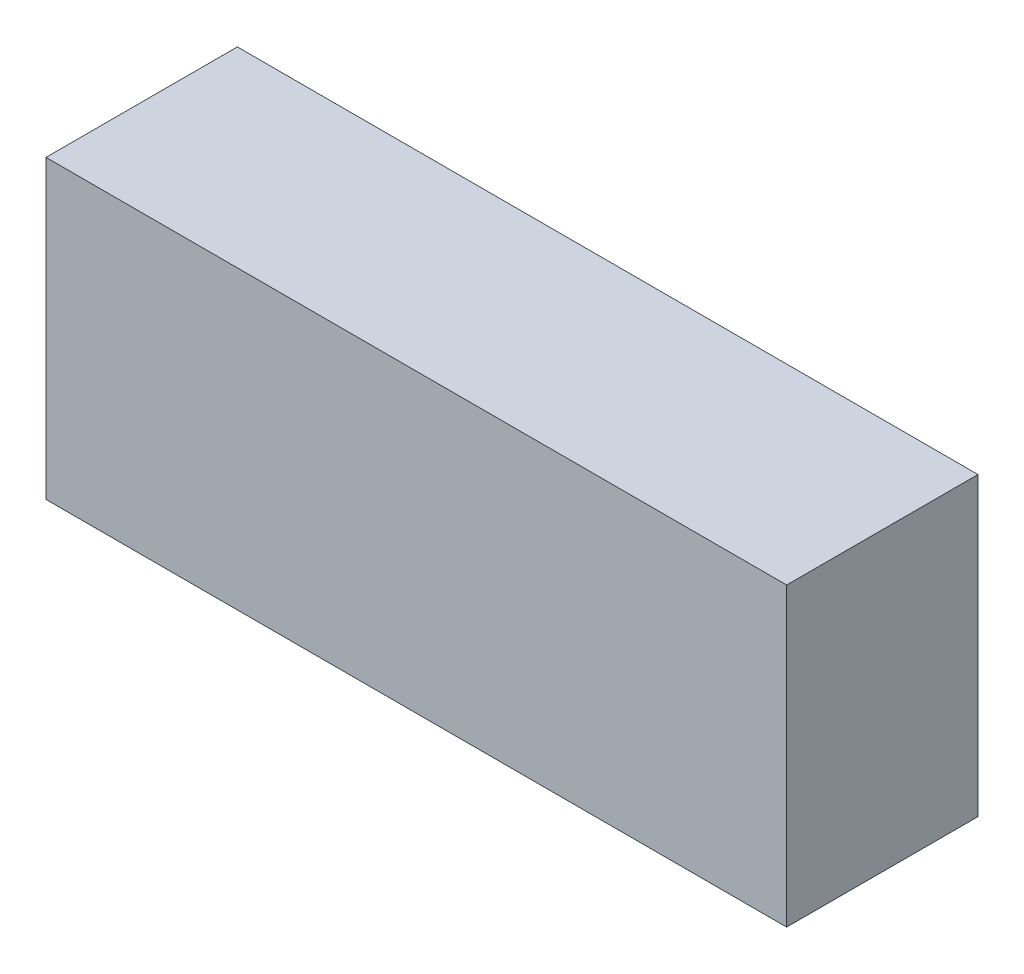
ISO-10303-21;
HEADER;
FILE_DESCRIPTION(('STEP AP214'),'2;1');
FILE_NAME('part.step','',(''),(''),'','','');
FILE_SCHEMA(('AUTOMOTIVE_DESIGN { 1 0 10303 214 1 1 1 1 }'));
ENDSEC;
DATA;
#1=APPLICATION_CONTEXT('core data for automotive mechanical design processes');
#2=APPLICATION_PROTOCOL_DEFINITION('international standard','automotive_design',2000,#1);
#3=PRODUCT_CONTEXT('',#1,'mechanical');
#4=PRODUCT('Part','Part','',(#3));
#5=PRODUCT_RELATED_PRODUCT_CATEGORY('part','',(#4));
#6=PRODUCT_DEFINITION_FORMATION('','',#4);
#7=PRODUCT_DEFINITION_CONTEXT('part definition',#1,'design');
#8=PRODUCT_DEFINITION('design','',#6,#7);
#9=PRODUCT_DEFINITION_SHAPE('','',#8);
#10=(LENGTH_UNIT() NAMED_UNIT(*) SI_UNIT(.MILLI.,.METRE.));
#11=(NAMED_UNIT(*) PLANE_ANGLE_UNIT() SI_UNIT($,.RADIAN.));
#12=(NAMED_UNIT(*) SI_UNIT($,.STERADIAN.) SOLID_ANGLE_UNIT());
#13=UNCERTAINTY_MEASURE_WITH_UNIT(LENGTH_MEASURE(1.E-05),#10,'distance_accuracy_value','');
#14=(GEOMETRIC_REPRESENTATION_CONTEXT(3) GLOBAL_UNCERTAINTY_ASSIGNED_CONTEXT((#13)) GLOBAL_UNIT_ASSIGNED_CONTEXT((#10,
#11,#12)) REPRESENTATION_CONTEXT('',''));
#15=CARTESIAN_POINT('',(0.,0.,0.));
#16=DIRECTION('',(0.,0.,1.));
#17=DIRECTION('',(1.,0.,0.));
#18=AXIS2_PLACEMENT_3D('',#15,#16,#17);
#19=CARTESIAN_POINT('',(-0.9,4.04,0.31));
#20=DIRECTION('',(0.,0.,1.));
#21=DIRECTION('',(1.,0.,0.));
#22=AXIS2_PLACEMENT_3D('',#19,#20,#21);
#23=PLANE('',#22);
#24=DIRECTION('',(1.,0.,0.));
#25=VECTOR('',#24,1.);
#26=CARTESIAN_POINT('',(-0.9,3.56,0.31));
#27=LINE('',#26,#25);
#28=CARTESIAN_POINT('',(0.3,3.56,0.31));
#29=VERTEX_POINT('',#28);
#30=CARTESIAN_POINT('',(-0.9,3.56,0.31));
#31=VERTEX_POINT('',#30);
#32=EDGE_CURVE('E76',#29,#31,#27,.F.);
#33=ORIENTED_EDGE('',*,*,#32,.F.);
#34=DIRECTION('',(0.,1.,0.));
#35=VECTOR('',#34,1.);
#36=CARTESIAN_POINT('',(0.3,4.04,0.31));
#37=LINE('',#36,#35);
#38=CARTESIAN_POINT('',(0.3,4.04,0.31));
#39=VERTEX_POINT('',#38);
#40=EDGE_CURVE('E58',#39,#29,#37,.F.);
#41=ORIENTED_EDGE('',*,*,#40,.F.);
#42=DIRECTION('',(1.,0.,0.));
#43=VECTOR('',#42,1.);
#44=CARTESIAN_POINT('',(-0.9,4.04,0.31));
#45=LINE('',#44,#43);
#46=CARTESIAN_POINT('',(-0.9,4.04,0.31));
#47=VERTEX_POINT('',#46);
#48=EDGE_CURVE('E20',#39,#47,#45,.F.);
#49=ORIENTED_EDGE('',*,*,#48,.T.);
#50=DIRECTION('',(0.,1.,0.));
#51=VECTOR('',#50,1.);
#52=CARTESIAN_POINT('',(-0.9,4.04,0.31));
#53=LINE('',#52,#51);
#54=EDGE_CURVE('E55',#47,#31,#53,.F.);
#55=ORIENTED_EDGE('',*,*,#54,.T.);
#56=EDGE_LOOP('',(#33,#41,#49,#55));
#57=FACE_BOUND('',#56,.T.);
#58=ADVANCED_FACE('F17',(#57),#23,.T.);
#59=CARTESIAN_POINT('',(-0.9,4.04,0.));
#60=DIRECTION('',(0.,-1.,0.));
#61=DIRECTION('',(1.,0.,0.));
#62=AXIS2_PLACEMENT_3D('',#59,#60,#61);
#63=PLANE('',#62);
#64=DIRECTION('',(0.,0.,1.));
#65=VECTOR('',#64,1.);
#66=CARTESIAN_POINT('',(0.3,4.04,0.));
#67=LINE('',#66,#65);
#68=CARTESIAN_POINT('',(0.3,4.04,0.));
#69=VERTEX_POINT('',#68);
#70=EDGE_CURVE('E78',#69,#39,#67,.T.);
#71=ORIENTED_EDGE('',*,*,#70,.F.);
#72=DIRECTION('',(1.,0.,0.));
#73=VECTOR('',#72,1.);
#74=CARTESIAN_POINT('',(-0.9,4.04,0.));
#75=LINE('',#74,#73);
#76=CARTESIAN_POINT('',(-0.9,4.04,0.));
#77=VERTEX_POINT('',#76);
#78=EDGE_CURVE('E73',#69,#77,#75,.F.);
#79=ORIENTED_EDGE('',*,*,#78,.T.);
#80=DIRECTION('',(0.,0.,1.));
#81=VECTOR('',#80,1.);
#82=CARTESIAN_POINT('',(-0.9,4.04,0.));
#83=LINE('',#82,#81);
#84=EDGE_CURVE('E63',#77,#47,#83,.T.);
#85=ORIENTED_EDGE('',*,*,#84,.T.);
#86=ORIENTED_EDGE('',*,*,#48,.F.);
#87=EDGE_LOOP('',(#71,#79,#85,#86));
#88=FACE_BOUND('',#87,.T.);
#89=ADVANCED_FACE('F72',(#88),#63,.F.);
#90=CARTESIAN_POINT('',(-0.9,4.04,0.));
#91=DIRECTION('',(1.,0.,0.));
#92=DIRECTION('',(0.,1.,0.));
#93=AXIS2_PLACEMENT_3D('',#90,#91,#92);
#94=PLANE('',#93);
#95=ORIENTED_EDGE('',*,*,#54,.F.);
#96=ORIENTED_EDGE('',*,*,#84,.F.);
#97=DIRECTION('',(0.,1.,0.));
#98=VECTOR('',#97,1.);
#99=CARTESIAN_POINT('',(-0.9,4.04,0.));
#100=LINE('',#99,#98);
#101=CARTESIAN_POINT('',(-0.9,3.56,0.));
#102=VERTEX_POINT('',#101);
#103=EDGE_CURVE('E83',#77,#102,#100,.F.);
#104=ORIENTED_EDGE('',*,*,#103,.T.);
#105=DIRECTION('',(0.,0.,1.));
#106=VECTOR('',#105,1.);
#107=CARTESIAN_POINT('',(-0.9,3.56,0.));
#108=LINE('',#107,#106);
#109=EDGE_CURVE('E69',#31,#102,#108,.F.);
#110=ORIENTED_EDGE('',*,*,#109,.F.);
#111=EDGE_LOOP('',(#95,#96,#104,#110));
#112=FACE_BOUND('',#111,.T.);
#113=ADVANCED_FACE('F66',(#112),#94,.F.);
#114=CARTESIAN_POINT('',(-0.9,3.56,0.));
#115=DIRECTION('',(0.,-1.,0.));
#116=DIRECTION('',(1.,0.,0.));
#117=AXIS2_PLACEMENT_3D('',#114,#115,#116);
#118=PLANE('',#117);
#119=DIRECTION('',(0.,0.,1.));
#120=VECTOR('',#119,1.);
#121=CARTESIAN_POINT('',(0.3,3.56,0.));
#122=LINE('',#121,#120);
#123=CARTESIAN_POINT('',(0.3,3.56,0.));
#124=VERTEX_POINT('',#123);
#125=EDGE_CURVE('E34',#29,#124,#122,.F.);
#126=ORIENTED_EDGE('',*,*,#125,.F.);
#127=ORIENTED_EDGE('',*,*,#32,.T.);
#128=ORIENTED_EDGE('',*,*,#109,.T.);
#129=DIRECTION('',(1.,0.,0.));
#130=VECTOR('',#129,1.);
#131=CARTESIAN_POINT('',(-0.9,3.56,0.));
#132=LINE('',#131,#130);
#133=EDGE_CURVE('E26',#102,#124,#132,.T.);
#134=ORIENTED_EDGE('',*,*,#133,.T.);
#135=EDGE_LOOP('',(#126,#127,#128,#134));
#136=FACE_BOUND('',#135,.T.);
#137=ADVANCED_FACE('F88',(#136),#118,.T.);
#138=CARTESIAN_POINT('',(0.3,4.04,0.));
#139=DIRECTION('',(1.,0.,0.));
#140=DIRECTION('',(0.,1.,0.));
#141=AXIS2_PLACEMENT_3D('',#138,#139,#140);
#142=PLANE('',#141);
#143=ORIENTED_EDGE('',*,*,#40,.T.);
#144=ORIENTED_EDGE('',*,*,#125,.T.);
#145=DIRECTION('',(0.,1.,0.));
#146=VECTOR('',#145,1.);
#147=CARTESIAN_POINT('',(0.3,4.04,0.));
#148=LINE('',#147,#146);
#149=EDGE_CURVE('E11',#124,#69,#148,.T.);
#150=ORIENTED_EDGE('',*,*,#149,.T.);
#151=ORIENTED_EDGE('',*,*,#70,.T.);
#152=EDGE_LOOP('',(#143,#144,#150,#151));
#153=FACE_BOUND('',#152,.T.);
#154=ADVANCED_FACE('F91',(#153),#142,.T.);
#155=CARTESIAN_POINT('',(-0.9,4.04,0.));
#156=DIRECTION('',(0.,0.,1.));
#157=DIRECTION('',(1.,0.,0.));
#158=AXIS2_PLACEMENT_3D('',#155,#156,#157);
#159=PLANE('',#158);
#160=ORIENTED_EDGE('',*,*,#133,.F.);
#161=ORIENTED_EDGE('',*,*,#103,.F.);
#162=ORIENTED_EDGE('',*,*,#78,.F.);
#163=ORIENTED_EDGE('',*,*,#149,.F.);
#164=EDGE_LOOP('',(#160,#161,#162,#163));
#165=FACE_BOUND('',#164,.T.);
#166=ADVANCED_FACE('F90',(#165),#159,.F.);
#167=CLOSED_SHELL('',(#58,#89,#113,#137,#154,#166));
#168=MANIFOLD_SOLID_BREP('B1',#167);
#169=ADVANCED_BREP_SHAPE_REPRESENTATION('',(#18,#168),#14);
#170=SHAPE_DEFINITION_REPRESENTATION(#9,#169);
ENDSEC;
END-ISO-10303-21;
